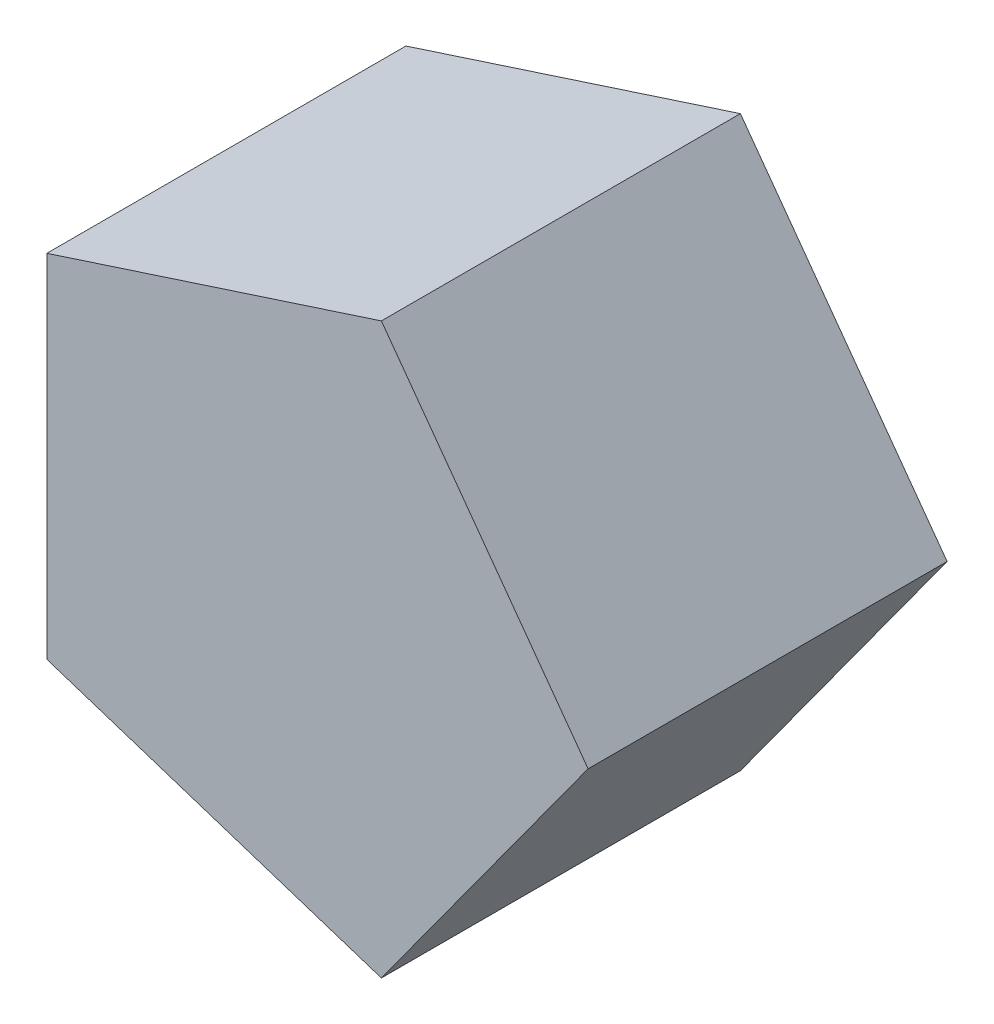
ISO-10303-21;
HEADER;
FILE_DESCRIPTION(('STEP AP214'),'2;1');
FILE_NAME('part.step','',(''),(''),'','','');
FILE_SCHEMA(('AUTOMOTIVE_DESIGN { 1 0 10303 214 1 1 1 1 }'));
ENDSEC;
DATA;
#1=APPLICATION_CONTEXT('core data for automotive mechanical design processes');
#2=APPLICATION_PROTOCOL_DEFINITION('international standard','automotive_design',2000,#1);
#3=PRODUCT_CONTEXT('',#1,'mechanical');
#4=PRODUCT('Part','Part','',(#3));
#5=PRODUCT_RELATED_PRODUCT_CATEGORY('part','',(#4));
#6=PRODUCT_DEFINITION_FORMATION('','',#4);
#7=PRODUCT_DEFINITION_CONTEXT('part definition',#1,'design');
#8=PRODUCT_DEFINITION('design','',#6,#7);
#9=PRODUCT_DEFINITION_SHAPE('','',#8);
#10=(LENGTH_UNIT() NAMED_UNIT(*) SI_UNIT(.MILLI.,.METRE.));
#11=(NAMED_UNIT(*) PLANE_ANGLE_UNIT() SI_UNIT($,.RADIAN.));
#12=(NAMED_UNIT(*) SI_UNIT($,.STERADIAN.) SOLID_ANGLE_UNIT());
#13=UNCERTAINTY_MEASURE_WITH_UNIT(LENGTH_MEASURE(1.E-05),#10,'distance_accuracy_value','');
#14=(GEOMETRIC_REPRESENTATION_CONTEXT(3) GLOBAL_UNCERTAINTY_ASSIGNED_CONTEXT((#13)) GLOBAL_UNIT_ASSIGNED_CONTEXT((#10,
#11,#12)) REPRESENTATION_CONTEXT('',''));
#15=CARTESIAN_POINT('',(0.,0.,0.));
#16=DIRECTION('',(0.,0.,1.));
#17=DIRECTION('',(1.,0.,0.));
#18=AXIS2_PLACEMENT_3D('',#15,#16,#17);
#19=CARTESIAN_POINT('',(7.72542485937368,-23.7764129073788,30.));
#20=DIRECTION('',(-0.809016994374947,0.587785252292473,0.));
#21=DIRECTION('',(-0.587785252292473,-0.809016994374947,0.));
#22=AXIS2_PLACEMENT_3D('',#19,#20,#21);
#23=PLANE('',#22);
#24=DIRECTION('',(0.587785252292473,0.809016994374947,0.));
#25=VECTOR('',#24,1.);
#26=CARTESIAN_POINT('',(7.72542485937368,-23.7764129073788,0.));
#27=LINE('',#26,#25);
#28=CARTESIAN_POINT('',(7.72542485937368,-23.7764129073788,0.));
#29=VERTEX_POINT('',#28);
#30=CARTESIAN_POINT('',(25.,0.,0.));
#31=VERTEX_POINT('',#30);
#32=EDGE_CURVE('E106',#29,#31,#27,.T.);
#33=ORIENTED_EDGE('',*,*,#32,.T.);
#34=DIRECTION('',(0.,0.,-1.));
#35=VECTOR('',#34,1.);
#36=CARTESIAN_POINT('',(25.,0.,30.));
#37=LINE('',#36,#35);
#38=CARTESIAN_POINT('',(25.,0.,30.));
#39=VERTEX_POINT('',#38);
#40=EDGE_CURVE('E11',#39,#31,#37,.T.);
#41=ORIENTED_EDGE('',*,*,#40,.F.);
#42=DIRECTION('',(0.587785252292473,0.809016994374947,0.));
#43=VECTOR('',#42,1.);
#44=CARTESIAN_POINT('',(7.72542485937368,-23.7764129073788,30.));
#45=LINE('',#44,#43);
#46=CARTESIAN_POINT('',(7.72542485937368,-23.7764129073788,30.));
#47=VERTEX_POINT('',#46);
#48=EDGE_CURVE('E114',#47,#39,#45,.T.);
#49=ORIENTED_EDGE('',*,*,#48,.F.);
#50=DIRECTION('',(0.,0.,-1.));
#51=VECTOR('',#50,1.);
#52=CARTESIAN_POINT('',(7.72542485937368,-23.7764129073788,30.));
#53=LINE('',#52,#51);
#54=EDGE_CURVE('E102',#47,#29,#53,.T.);
#55=ORIENTED_EDGE('',*,*,#54,.T.);
#56=EDGE_LOOP('',(#33,#41,#49,#55));
#57=FACE_BOUND('',#56,.T.);
#58=ADVANCED_FACE('F32',(#57),#23,.F.);
#59=CARTESIAN_POINT('',(25.,0.,30.));
#60=DIRECTION('',(-0.809016994374948,-0.587785252292473,0.));
#61=DIRECTION('',(0.587785252292473,-0.809016994374948,0.));
#62=AXIS2_PLACEMENT_3D('',#59,#60,#61);
#63=PLANE('',#62);
#64=DIRECTION('',(-0.587785252292473,0.809016994374948,0.));
#65=VECTOR('',#64,1.);
#66=CARTESIAN_POINT('',(25.,0.,0.));
#67=LINE('',#66,#65);
#68=CARTESIAN_POINT('',(7.72542485937368,23.7764129073789,0.));
#69=VERTEX_POINT('',#68);
#70=EDGE_CURVE('E109',#31,#69,#67,.T.);
#71=ORIENTED_EDGE('',*,*,#70,.T.);
#72=DIRECTION('',(0.,0.,-1.));
#73=VECTOR('',#72,1.);
#74=CARTESIAN_POINT('',(7.72542485937368,23.7764129073789,30.));
#75=LINE('',#74,#73);
#76=CARTESIAN_POINT('',(7.72542485937368,23.7764129073789,30.));
#77=VERTEX_POINT('',#76);
#78=EDGE_CURVE('E40',#77,#69,#75,.T.);
#79=ORIENTED_EDGE('',*,*,#78,.F.);
#80=DIRECTION('',(-0.587785252292473,0.809016994374948,0.));
#81=VECTOR('',#80,1.);
#82=CARTESIAN_POINT('',(25.,0.,30.));
#83=LINE('',#82,#81);
#84=EDGE_CURVE('E82',#39,#77,#83,.T.);
#85=ORIENTED_EDGE('',*,*,#84,.F.);
#86=ORIENTED_EDGE('',*,*,#40,.T.);
#87=EDGE_LOOP('',(#71,#79,#85,#86));
#88=FACE_BOUND('',#87,.T.);
#89=ADVANCED_FACE('F133',(#88),#63,.F.);
#90=CARTESIAN_POINT('',(7.72542485937368,23.7764129073789,30.));
#91=DIRECTION('',(0.309016994374947,-0.951056516295154,0.));
#92=DIRECTION('',(0.951056516295154,0.309016994374948,0.));
#93=AXIS2_PLACEMENT_3D('',#90,#91,#92);
#94=PLANE('',#93);
#95=DIRECTION('',(-0.951056516295154,-0.309016994374947,0.));
#96=VECTOR('',#95,1.);
#97=CARTESIAN_POINT('',(7.72542485937368,23.7764129073789,0.));
#98=LINE('',#97,#96);
#99=CARTESIAN_POINT('',(-20.2254248593737,14.6946313073118,0.));
#100=VERTEX_POINT('',#99);
#101=EDGE_CURVE('E97',#69,#100,#98,.T.);
#102=ORIENTED_EDGE('',*,*,#101,.T.);
#103=DIRECTION('',(0.,0.,-1.));
#104=VECTOR('',#103,1.);
#105=CARTESIAN_POINT('',(-20.2254248593737,14.6946313073118,30.));
#106=LINE('',#105,#104);
#107=CARTESIAN_POINT('',(-20.2254248593737,14.6946313073118,30.));
#108=VERTEX_POINT('',#107);
#109=EDGE_CURVE('E94',#108,#100,#106,.T.);
#110=ORIENTED_EDGE('',*,*,#109,.F.);
#111=DIRECTION('',(-0.951056516295154,-0.309016994374947,0.));
#112=VECTOR('',#111,1.);
#113=CARTESIAN_POINT('',(7.72542485937368,23.7764129073789,30.));
#114=LINE('',#113,#112);
#115=EDGE_CURVE('E86',#77,#108,#114,.T.);
#116=ORIENTED_EDGE('',*,*,#115,.F.);
#117=ORIENTED_EDGE('',*,*,#78,.T.);
#118=EDGE_LOOP('',(#102,#110,#116,#117));
#119=FACE_BOUND('',#118,.T.);
#120=ADVANCED_FACE('F95',(#119),#94,.F.);
#121=CARTESIAN_POINT('',(-20.2254248593737,14.6946313073118,30.));
#122=DIRECTION('',(1.,0.,0.));
#123=DIRECTION('',(0.,0.,-1.));
#124=AXIS2_PLACEMENT_3D('',#121,#122,#123);
#125=PLANE('',#124);
#126=DIRECTION('',(0.,-1.,0.));
#127=VECTOR('',#126,1.);
#128=CARTESIAN_POINT('',(-20.2254248593737,14.6946313073118,0.));
#129=LINE('',#128,#127);
#130=CARTESIAN_POINT('',(-20.2254248593737,-14.6946313073118,0.));
#131=VERTEX_POINT('',#130);
#132=EDGE_CURVE('E68',#100,#131,#129,.T.);
#133=ORIENTED_EDGE('',*,*,#132,.T.);
#134=DIRECTION('',(0.,0.,-1.));
#135=VECTOR('',#134,1.);
#136=CARTESIAN_POINT('',(-20.2254248593737,-14.6946313073118,30.));
#137=LINE('',#136,#135);
#138=CARTESIAN_POINT('',(-20.2254248593737,-14.6946313073118,30.));
#139=VERTEX_POINT('',#138);
#140=EDGE_CURVE('E98',#139,#131,#137,.T.);
#141=ORIENTED_EDGE('',*,*,#140,.F.);
#142=DIRECTION('',(0.,-1.,0.));
#143=VECTOR('',#142,1.);
#144=CARTESIAN_POINT('',(-20.2254248593737,14.6946313073118,30.));
#145=LINE('',#144,#143);
#146=EDGE_CURVE('E90',#108,#139,#145,.T.);
#147=ORIENTED_EDGE('',*,*,#146,.F.);
#148=ORIENTED_EDGE('',*,*,#109,.T.);
#149=EDGE_LOOP('',(#133,#141,#147,#148));
#150=FACE_BOUND('',#149,.T.);
#151=ADVANCED_FACE('F100',(#150),#125,.F.);
#152=CARTESIAN_POINT('',(-20.2254248593737,-14.6946313073118,30.));
#153=DIRECTION('',(0.309016994374947,0.951056516295154,0.));
#154=DIRECTION('',(-0.951056516295154,0.309016994374947,0.));
#155=AXIS2_PLACEMENT_3D('',#152,#153,#154);
#156=PLANE('',#155);
#157=DIRECTION('',(0.951056516295154,-0.309016994374947,0.));
#158=VECTOR('',#157,1.);
#159=CARTESIAN_POINT('',(-20.2254248593737,-14.6946313073118,0.));
#160=LINE('',#159,#158);
#161=EDGE_CURVE('E74',#131,#29,#160,.T.);
#162=ORIENTED_EDGE('',*,*,#161,.T.);
#163=ORIENTED_EDGE('',*,*,#54,.F.);
#164=DIRECTION('',(0.951056516295154,-0.309016994374947,0.));
#165=VECTOR('',#164,1.);
#166=CARTESIAN_POINT('',(-20.2254248593737,-14.6946313073118,30.));
#167=LINE('',#166,#165);
#168=EDGE_CURVE('E48',#139,#47,#167,.T.);
#169=ORIENTED_EDGE('',*,*,#168,.F.);
#170=ORIENTED_EDGE('',*,*,#140,.T.);
#171=EDGE_LOOP('',(#162,#163,#169,#170));
#172=FACE_BOUND('',#171,.T.);
#173=ADVANCED_FACE('F122',(#172),#156,.F.);
#174=CARTESIAN_POINT('',(0.,0.,30.));
#175=DIRECTION('',(0.,0.,1.));
#176=DIRECTION('',(1.,0.,0.));
#177=AXIS2_PLACEMENT_3D('',#174,#175,#176);
#178=PLANE('',#177);
#179=ORIENTED_EDGE('',*,*,#48,.T.);
#180=ORIENTED_EDGE('',*,*,#84,.T.);
#181=ORIENTED_EDGE('',*,*,#115,.T.);
#182=ORIENTED_EDGE('',*,*,#146,.T.);
#183=ORIENTED_EDGE('',*,*,#168,.T.);
#184=EDGE_LOOP('',(#179,#180,#181,#182,#183));
#185=FACE_BOUND('',#184,.T.);
#186=ADVANCED_FACE('F88',(#185),#178,.T.);
#187=CARTESIAN_POINT('',(0.,0.,0.));
#188=DIRECTION('',(0.,0.,1.));
#189=DIRECTION('',(1.,0.,0.));
#190=AXIS2_PLACEMENT_3D('',#187,#188,#189);
#191=PLANE('',#190);
#192=ORIENTED_EDGE('',*,*,#32,.F.);
#193=ORIENTED_EDGE('',*,*,#161,.F.);
#194=ORIENTED_EDGE('',*,*,#132,.F.);
#195=ORIENTED_EDGE('',*,*,#101,.F.);
#196=ORIENTED_EDGE('',*,*,#70,.F.);
#197=EDGE_LOOP('',(#192,#193,#194,#195,#196));
#198=FACE_BOUND('',#197,.T.);
#199=ADVANCED_FACE('F118',(#198),#191,.F.);
#200=CLOSED_SHELL('',(#58,#89,#120,#151,#173,#186,#199));
#201=MANIFOLD_SOLID_BREP('B2',#200);
#202=ADVANCED_BREP_SHAPE_REPRESENTATION('',(#18,#201),#14);
#203=SHAPE_DEFINITION_REPRESENTATION(#9,#202);
ENDSEC;
END-ISO-10303-21;
